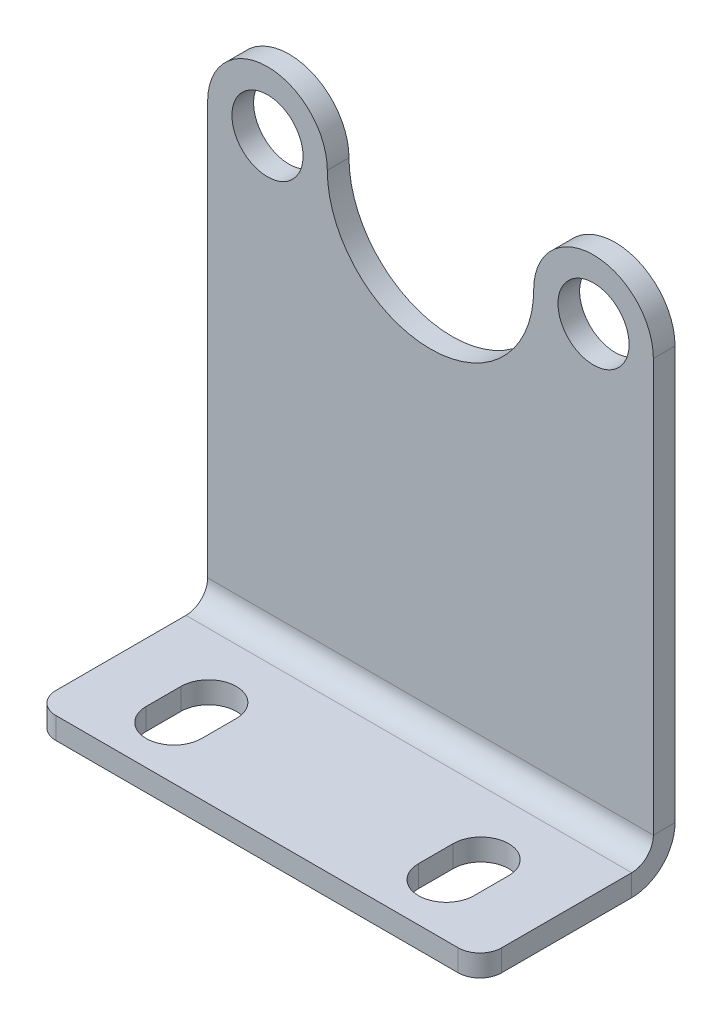
ISO-10303-21;
HEADER;
FILE_DESCRIPTION(('STEP AP214'),'2;1');
FILE_NAME('part.step','',(''),(''),'','','');
FILE_SCHEMA(('AUTOMOTIVE_DESIGN { 1 0 10303 214 1 1 1 1 }'));
ENDSEC;
DATA;
#1=APPLICATION_CONTEXT('core data for automotive mechanical design processes');
#2=APPLICATION_PROTOCOL_DEFINITION('international standard','automotive_design',2000,#1);
#3=PRODUCT_CONTEXT('',#1,'mechanical');
#4=PRODUCT('Part','Part','',(#3));
#5=PRODUCT_RELATED_PRODUCT_CATEGORY('part','',(#4));
#6=PRODUCT_DEFINITION_FORMATION('','',#4);
#7=PRODUCT_DEFINITION_CONTEXT('part definition',#1,'design');
#8=PRODUCT_DEFINITION('design','',#6,#7);
#9=PRODUCT_DEFINITION_SHAPE('','',#8);
#10=(LENGTH_UNIT() NAMED_UNIT(*) SI_UNIT(.MILLI.,.METRE.));
#11=(NAMED_UNIT(*) PLANE_ANGLE_UNIT() SI_UNIT($,.RADIAN.));
#12=(NAMED_UNIT(*) SI_UNIT($,.STERADIAN.) SOLID_ANGLE_UNIT());
#13=UNCERTAINTY_MEASURE_WITH_UNIT(LENGTH_MEASURE(1.E-05),#10,'distance_accuracy_value','');
#14=(GEOMETRIC_REPRESENTATION_CONTEXT(3) GLOBAL_UNCERTAINTY_ASSIGNED_CONTEXT((#13)) GLOBAL_UNIT_ASSIGNED_CONTEXT((#10,
#11,#12)) REPRESENTATION_CONTEXT('',''));
#15=CARTESIAN_POINT('',(0.,0.,0.));
#16=DIRECTION('',(0.,0.,1.));
#17=DIRECTION('',(1.,0.,0.));
#18=AXIS2_PLACEMENT_3D('',#15,#16,#17);
#19=CARTESIAN_POINT('',(56.642,3.175,15.73022));
#20=DIRECTION('',(1.,0.,0.));
#21=DIRECTION('',(0.,0.,-1.));
#22=AXIS2_PLACEMENT_3D('',#19,#20,#21);
#23=PLANE('',#22);
#24=DIRECTION('',(0.,1.,0.));
#25=VECTOR('',#24,1.);
#26=CARTESIAN_POINT('',(56.642,3.175,15.73022));
#27=LINE('',#26,#25);
#28=CARTESIAN_POINT('',(56.642,0.,15.73022));
#29=VERTEX_POINT('',#28);
#30=CARTESIAN_POINT('',(56.642,3.175,15.73022));
#31=VERTEX_POINT('',#30);
#32=EDGE_CURVE('E11',#29,#31,#27,.T.);
#33=ORIENTED_EDGE('',*,*,#32,.F.);
#34=DIRECTION('',(0.,0.,1.));
#35=VECTOR('',#34,1.);
#36=CARTESIAN_POINT('',(56.642,0.,0.));
#37=LINE('',#36,#35);
#38=CARTESIAN_POINT('',(56.642,0.,20.81022));
#39=VERTEX_POINT('',#38);
#40=EDGE_CURVE('E151',#39,#29,#37,.F.);
#41=ORIENTED_EDGE('',*,*,#40,.F.);
#42=DIRECTION('',(0.,1.,0.));
#43=VECTOR('',#42,1.);
#44=CARTESIAN_POINT('',(56.642,3.175,20.81022));
#45=LINE('',#44,#43);
#46=CARTESIAN_POINT('',(56.642,3.175,20.81022));
#47=VERTEX_POINT('',#46);
#48=EDGE_CURVE('E54',#39,#47,#45,.T.);
#49=ORIENTED_EDGE('',*,*,#48,.T.);
#50=DIRECTION('',(0.,0.,-1.));
#51=VECTOR('',#50,1.);
#52=CARTESIAN_POINT('',(56.642,3.175,15.73022));
#53=LINE('',#52,#51);
#54=EDGE_CURVE('E243',#47,#31,#53,.T.);
#55=ORIENTED_EDGE('',*,*,#54,.T.);
#56=EDGE_LOOP('',(#33,#41,#49,#55));
#57=FACE_BOUND('',#56,.T.);
#58=ADVANCED_FACE('F43',(#57),#23,.F.);
#59=CARTESIAN_POINT('',(52.578,3.175,20.81022));
#60=DIRECTION('',(0.,1.,0.));
#61=DIRECTION('',(0.,0.,1.));
#62=AXIS2_PLACEMENT_3D('',#59,#60,#61);
#63=CYLINDRICAL_SURFACE('',#62,4.064);
#64=ORIENTED_EDGE('',*,*,#48,.F.);
#65=CARTESIAN_POINT('',(52.578,0.,20.81022));
#66=DIRECTION('',(0.,1.,0.));
#67=DIRECTION('',(0.,0.,1.));
#68=AXIS2_PLACEMENT_3D('',#65,#66,#67);
#69=CIRCLE('',#68,4.064);
#70=CARTESIAN_POINT('',(48.514,0.,20.81022));
#71=VERTEX_POINT('',#70);
#72=EDGE_CURVE('E168',#71,#39,#69,.T.);
#73=ORIENTED_EDGE('',*,*,#72,.F.);
#74=DIRECTION('',(0.,1.,0.));
#75=VECTOR('',#74,1.);
#76=CARTESIAN_POINT('',(48.514,3.175,20.81022));
#77=LINE('',#76,#75);
#78=CARTESIAN_POINT('',(48.514,3.175,20.81022));
#79=VERTEX_POINT('',#78);
#80=EDGE_CURVE('E143',#71,#79,#77,.T.);
#81=ORIENTED_EDGE('',*,*,#80,.T.);
#82=CARTESIAN_POINT('',(52.578,3.175,20.81022));
#83=DIRECTION('',(0.,1.,0.));
#84=DIRECTION('',(0.,0.,-1.));
#85=AXIS2_PLACEMENT_3D('',#82,#83,#84);
#86=CIRCLE('',#85,4.064);
#87=EDGE_CURVE('E251',#79,#47,#86,.T.);
#88=ORIENTED_EDGE('',*,*,#87,.T.);
#89=EDGE_LOOP('',(#64,#73,#81,#88));
#90=FACE_BOUND('',#89,.T.);
#91=ADVANCED_FACE('F254',(#90),#63,.F.);
#92=CARTESIAN_POINT('',(48.514,3.175,15.73022));
#93=DIRECTION('',(-1.,0.,0.));
#94=DIRECTION('',(0.,0.,1.));
#95=AXIS2_PLACEMENT_3D('',#92,#93,#94);
#96=PLANE('',#95);
#97=ORIENTED_EDGE('',*,*,#80,.F.);
#98=DIRECTION('',(0.,0.,1.));
#99=VECTOR('',#98,1.);
#100=CARTESIAN_POINT('',(48.514,0.,0.));
#101=LINE('',#100,#99);
#102=CARTESIAN_POINT('',(48.514,0.,15.73022));
#103=VERTEX_POINT('',#102);
#104=EDGE_CURVE('E149',#103,#71,#101,.T.);
#105=ORIENTED_EDGE('',*,*,#104,.F.);
#106=DIRECTION('',(0.,1.,0.));
#107=VECTOR('',#106,1.);
#108=CARTESIAN_POINT('',(48.514,3.175,15.73022));
#109=LINE('',#108,#107);
#110=CARTESIAN_POINT('',(48.514,3.175,15.73022));
#111=VERTEX_POINT('',#110);
#112=EDGE_CURVE('E47',#103,#111,#109,.T.);
#113=ORIENTED_EDGE('',*,*,#112,.T.);
#114=DIRECTION('',(0.,0.,1.));
#115=VECTOR('',#114,1.);
#116=CARTESIAN_POINT('',(48.514,3.175,15.73022));
#117=LINE('',#116,#115);
#118=EDGE_CURVE('E496',#111,#79,#117,.T.);
#119=ORIENTED_EDGE('',*,*,#118,.T.);
#120=EDGE_LOOP('',(#97,#105,#113,#119));
#121=FACE_BOUND('',#120,.T.);
#122=ADVANCED_FACE('F154',(#121),#96,.F.);
#123=CARTESIAN_POINT('',(16.764,3.175,15.73022));
#124=DIRECTION('',(1.,0.,0.));
#125=DIRECTION('',(0.,0.,-1.));
#126=AXIS2_PLACEMENT_3D('',#123,#124,#125);
#127=PLANE('',#126);
#128=DIRECTION('',(0.,1.,0.));
#129=VECTOR('',#128,1.);
#130=CARTESIAN_POINT('',(16.764,3.175,15.73022));
#131=LINE('',#130,#129);
#132=CARTESIAN_POINT('',(16.764,0.,15.73022));
#133=VERTEX_POINT('',#132);
#134=CARTESIAN_POINT('',(16.764,3.175,15.73022));
#135=VERTEX_POINT('',#134);
#136=EDGE_CURVE('E144',#133,#135,#131,.T.);
#137=ORIENTED_EDGE('',*,*,#136,.F.);
#138=DIRECTION('',(0.,0.,1.));
#139=VECTOR('',#138,1.);
#140=CARTESIAN_POINT('',(16.764,0.,0.));
#141=LINE('',#140,#139);
#142=CARTESIAN_POINT('',(16.764,0.,20.81022));
#143=VERTEX_POINT('',#142);
#144=EDGE_CURVE('E162',#143,#133,#141,.F.);
#145=ORIENTED_EDGE('',*,*,#144,.F.);
#146=DIRECTION('',(0.,1.,0.));
#147=VECTOR('',#146,1.);
#148=CARTESIAN_POINT('',(16.764,3.175,20.81022));
#149=LINE('',#148,#147);
#150=CARTESIAN_POINT('',(16.764,3.175,20.81022));
#151=VERTEX_POINT('',#150);
#152=EDGE_CURVE('E225',#143,#151,#149,.T.);
#153=ORIENTED_EDGE('',*,*,#152,.T.);
#154=DIRECTION('',(0.,0.,-1.));
#155=VECTOR('',#154,1.);
#156=CARTESIAN_POINT('',(16.764,3.175,15.73022));
#157=LINE('',#156,#155);
#158=EDGE_CURVE('E490',#151,#135,#157,.T.);
#159=ORIENTED_EDGE('',*,*,#158,.T.);
#160=EDGE_LOOP('',(#137,#145,#153,#159));
#161=FACE_BOUND('',#160,.T.);
#162=ADVANCED_FACE('F508',(#161),#127,.F.);
#163=CARTESIAN_POINT('',(12.7,3.175,20.81022));
#164=DIRECTION('',(0.,1.,0.));
#165=DIRECTION('',(0.,0.,1.));
#166=AXIS2_PLACEMENT_3D('',#163,#164,#165);
#167=CYLINDRICAL_SURFACE('',#166,4.064);
#168=ORIENTED_EDGE('',*,*,#152,.F.);
#169=CARTESIAN_POINT('',(12.7,0.,20.81022));
#170=DIRECTION('',(0.,1.,0.));
#171=DIRECTION('',(0.,0.,1.));
#172=AXIS2_PLACEMENT_3D('',#169,#170,#171);
#173=CIRCLE('',#172,4.064);
#174=CARTESIAN_POINT('',(8.636,0.,20.81022));
#175=VERTEX_POINT('',#174);
#176=EDGE_CURVE('E157',#175,#143,#173,.T.);
#177=ORIENTED_EDGE('',*,*,#176,.F.);
#178=DIRECTION('',(0.,1.,0.));
#179=VECTOR('',#178,1.);
#180=CARTESIAN_POINT('',(8.636,3.175,20.81022));
#181=LINE('',#180,#179);
#182=CARTESIAN_POINT('',(8.636,3.175,20.81022));
#183=VERTEX_POINT('',#182);
#184=EDGE_CURVE('E221',#175,#183,#181,.T.);
#185=ORIENTED_EDGE('',*,*,#184,.T.);
#186=CARTESIAN_POINT('',(12.7,3.175,20.81022));
#187=DIRECTION('',(0.,1.,0.));
#188=DIRECTION('',(0.,0.,1.));
#189=AXIS2_PLACEMENT_3D('',#186,#187,#188);
#190=CIRCLE('',#189,4.064);
#191=EDGE_CURVE('E393',#183,#151,#190,.T.);
#192=ORIENTED_EDGE('',*,*,#191,.T.);
#193=EDGE_LOOP('',(#168,#177,#185,#192));
#194=FACE_BOUND('',#193,.T.);
#195=ADVANCED_FACE('F391',(#194),#167,.F.);
#196=CARTESIAN_POINT('',(8.636,3.175,15.73022));
#197=DIRECTION('',(-1.,0.,0.));
#198=DIRECTION('',(0.,0.,1.));
#199=AXIS2_PLACEMENT_3D('',#196,#197,#198);
#200=PLANE('',#199);
#201=ORIENTED_EDGE('',*,*,#184,.F.);
#202=DIRECTION('',(0.,0.,1.));
#203=VECTOR('',#202,1.);
#204=CARTESIAN_POINT('',(8.636,0.,0.));
#205=LINE('',#204,#203);
#206=CARTESIAN_POINT('',(8.636,0.,15.73022));
#207=VERTEX_POINT('',#206);
#208=EDGE_CURVE('E354',#207,#175,#205,.T.);
#209=ORIENTED_EDGE('',*,*,#208,.F.);
#210=DIRECTION('',(0.,1.,0.));
#211=VECTOR('',#210,1.);
#212=CARTESIAN_POINT('',(8.636,3.175,15.73022));
#213=LINE('',#212,#211);
#214=CARTESIAN_POINT('',(8.636,3.175,15.73022));
#215=VERTEX_POINT('',#214);
#216=EDGE_CURVE('E217',#207,#215,#213,.T.);
#217=ORIENTED_EDGE('',*,*,#216,.T.);
#218=DIRECTION('',(0.,0.,1.));
#219=VECTOR('',#218,1.);
#220=CARTESIAN_POINT('',(8.636,3.175,15.73022));
#221=LINE('',#220,#219);
#222=EDGE_CURVE('E387',#215,#183,#221,.T.);
#223=ORIENTED_EDGE('',*,*,#222,.T.);
#224=EDGE_LOOP('',(#201,#209,#217,#223));
#225=FACE_BOUND('',#224,.T.);
#226=ADVANCED_FACE('F382',(#225),#200,.F.);
#227=CARTESIAN_POINT('',(0.,3.175,3.175));
#228=DIRECTION('',(-1.,0.,0.));
#229=DIRECTION('',(0.,0.,1.));
#230=AXIS2_PLACEMENT_3D('',#227,#228,#229);
#231=PLANE('',#230);
#232=DIRECTION('',(0.,1.,0.));
#233=VECTOR('',#232,1.);
#234=CARTESIAN_POINT('',(0.,3.175,6.35));
#235=LINE('',#234,#233);
#236=CARTESIAN_POINT('',(0.,0.,6.35));
#237=VERTEX_POINT('',#236);
#238=CARTESIAN_POINT('',(0.,3.175,6.35));
#239=VERTEX_POINT('',#238);
#240=EDGE_CURVE('E213',#237,#239,#235,.T.);
#241=ORIENTED_EDGE('',*,*,#240,.F.);
#242=DIRECTION('',(0.,0.,1.));
#243=VECTOR('',#242,1.);
#244=CARTESIAN_POINT('',(0.,0.,0.));
#245=LINE('',#244,#243);
#246=CARTESIAN_POINT('',(0.,0.,25.4));
#247=VERTEX_POINT('',#246);
#248=EDGE_CURVE('E342',#237,#247,#245,.T.);
#249=ORIENTED_EDGE('',*,*,#248,.T.);
#250=DIRECTION('',(0.,1.,0.));
#251=VECTOR('',#250,1.);
#252=CARTESIAN_POINT('',(0.,3.175,25.4));
#253=LINE('',#252,#251);
#254=CARTESIAN_POINT('',(0.,3.175,25.4));
#255=VERTEX_POINT('',#254);
#256=EDGE_CURVE('E209',#247,#255,#253,.T.);
#257=ORIENTED_EDGE('',*,*,#256,.T.);
#258=DIRECTION('',(0.,0.,1.));
#259=VECTOR('',#258,1.);
#260=CARTESIAN_POINT('',(0.,3.175,3.175));
#261=LINE('',#260,#259);
#262=EDGE_CURVE('E421',#239,#255,#261,.T.);
#263=ORIENTED_EDGE('',*,*,#262,.F.);
#264=EDGE_LOOP('',(#241,#249,#257,#263));
#265=FACE_BOUND('',#264,.T.);
#266=ADVANCED_FACE('F422',(#265),#231,.T.);
#267=CARTESIAN_POINT('',(3.175,3.175,25.4));
#268=DIRECTION('',(0.,1.,0.));
#269=DIRECTION('',(0.,0.,1.));
#270=AXIS2_PLACEMENT_3D('',#267,#268,#269);
#271=CYLINDRICAL_SURFACE('',#270,3.175);
#272=ORIENTED_EDGE('',*,*,#256,.F.);
#273=CARTESIAN_POINT('',(3.175,0.,25.4));
#274=DIRECTION('',(0.,1.,0.));
#275=DIRECTION('',(0.,0.,1.));
#276=AXIS2_PLACEMENT_3D('',#273,#274,#275);
#277=CIRCLE('',#276,3.175);
#278=CARTESIAN_POINT('',(3.175,0.,28.575));
#279=VERTEX_POINT('',#278);
#280=EDGE_CURVE('E350',#247,#279,#277,.T.);
#281=ORIENTED_EDGE('',*,*,#280,.T.);
#282=DIRECTION('',(0.,1.,0.));
#283=VECTOR('',#282,1.);
#284=CARTESIAN_POINT('',(3.175,3.175,28.575));
#285=LINE('',#284,#283);
#286=CARTESIAN_POINT('',(3.175,3.175,28.575));
#287=VERTEX_POINT('',#286);
#288=EDGE_CURVE('E205',#279,#287,#285,.T.);
#289=ORIENTED_EDGE('',*,*,#288,.T.);
#290=CARTESIAN_POINT('',(3.175,3.175,25.4));
#291=DIRECTION('',(0.,1.,0.));
#292=DIRECTION('',(0.,0.,1.));
#293=AXIS2_PLACEMENT_3D('',#290,#291,#292);
#294=CIRCLE('',#293,3.175);
#295=EDGE_CURVE('E428',#255,#287,#294,.T.);
#296=ORIENTED_EDGE('',*,*,#295,.F.);
#297=EDGE_LOOP('',(#272,#281,#289,#296));
#298=FACE_BOUND('',#297,.T.);
#299=ADVANCED_FACE('F476',(#298),#271,.T.);
#300=CARTESIAN_POINT('',(0.,3.175,28.575));
#301=DIRECTION('',(0.,0.,1.));
#302=DIRECTION('',(1.,0.,0.));
#303=AXIS2_PLACEMENT_3D('',#300,#301,#302);
#304=PLANE('',#303);
#305=ORIENTED_EDGE('',*,*,#288,.F.);
#306=DIRECTION('',(1.,0.,0.));
#307=VECTOR('',#306,1.);
#308=CARTESIAN_POINT('',(0.,0.,28.575));
#309=LINE('',#308,#307);
#310=CARTESIAN_POINT('',(62.103,0.,28.575));
#311=VERTEX_POINT('',#310);
#312=EDGE_CURVE('E336',#279,#311,#309,.T.);
#313=ORIENTED_EDGE('',*,*,#312,.T.);
#314=DIRECTION('',(0.,1.,0.));
#315=VECTOR('',#314,1.);
#316=CARTESIAN_POINT('',(62.103,3.175,28.575));
#317=LINE('',#316,#315);
#318=CARTESIAN_POINT('',(62.103,3.175,28.575));
#319=VERTEX_POINT('',#318);
#320=EDGE_CURVE('E201',#311,#319,#317,.T.);
#321=ORIENTED_EDGE('',*,*,#320,.T.);
#322=DIRECTION('',(1.,0.,0.));
#323=VECTOR('',#322,1.);
#324=CARTESIAN_POINT('',(0.,3.175,28.575));
#325=LINE('',#324,#323);
#326=EDGE_CURVE('E304',#287,#319,#325,.T.);
#327=ORIENTED_EDGE('',*,*,#326,.F.);
#328=EDGE_LOOP('',(#305,#313,#321,#327));
#329=FACE_BOUND('',#328,.T.);
#330=ADVANCED_FACE('F516',(#329),#304,.T.);
#331=CARTESIAN_POINT('',(62.103,3.175,25.4));
#332=DIRECTION('',(0.,1.,0.));
#333=DIRECTION('',(0.,0.,1.));
#334=AXIS2_PLACEMENT_3D('',#331,#332,#333);
#335=CYLINDRICAL_SURFACE('',#334,3.175);
#336=ORIENTED_EDGE('',*,*,#320,.F.);
#337=CARTESIAN_POINT('',(62.103,0.,25.4));
#338=DIRECTION('',(0.,1.,0.));
#339=DIRECTION('',(0.,0.,1.));
#340=AXIS2_PLACEMENT_3D('',#337,#338,#339);
#341=CIRCLE('',#340,3.175);
#342=CARTESIAN_POINT('',(65.278,0.,25.4));
#343=VERTEX_POINT('',#342);
#344=EDGE_CURVE('E343',#311,#343,#341,.T.);
#345=ORIENTED_EDGE('',*,*,#344,.T.);
#346=DIRECTION('',(0.,1.,0.));
#347=VECTOR('',#346,1.);
#348=CARTESIAN_POINT('',(65.278,3.175,25.4));
#349=LINE('',#348,#347);
#350=CARTESIAN_POINT('',(65.278,3.175,25.4));
#351=VERTEX_POINT('',#350);
#352=EDGE_CURVE('E197',#343,#351,#349,.T.);
#353=ORIENTED_EDGE('',*,*,#352,.T.);
#354=CARTESIAN_POINT('',(62.103,3.175,25.4));
#355=DIRECTION('',(0.,1.,0.));
#356=DIRECTION('',(0.,0.,1.));
#357=AXIS2_PLACEMENT_3D('',#354,#355,#356);
#358=CIRCLE('',#357,3.175);
#359=EDGE_CURVE('E439',#319,#351,#358,.T.);
#360=ORIENTED_EDGE('',*,*,#359,.F.);
#361=EDGE_LOOP('',(#336,#345,#353,#360));
#362=FACE_BOUND('',#361,.T.);
#363=ADVANCED_FACE('F520',(#362),#335,.T.);
#364=CARTESIAN_POINT('',(65.278,3.175,3.175));
#365=DIRECTION('',(1.,0.,0.));
#366=DIRECTION('',(0.,0.,-1.));
#367=AXIS2_PLACEMENT_3D('',#364,#365,#366);
#368=PLANE('',#367);
#369=ORIENTED_EDGE('',*,*,#352,.F.);
#370=DIRECTION('',(0.,0.,1.));
#371=VECTOR('',#370,1.);
#372=CARTESIAN_POINT('',(65.278,0.,0.));
#373=LINE('',#372,#371);
#374=CARTESIAN_POINT('',(65.278,0.,6.35));
#375=VERTEX_POINT('',#374);
#376=EDGE_CURVE('E338',#343,#375,#373,.F.);
#377=ORIENTED_EDGE('',*,*,#376,.T.);
#378=DIRECTION('',(0.,1.,0.));
#379=VECTOR('',#378,1.);
#380=CARTESIAN_POINT('',(65.278,3.175,6.35));
#381=LINE('',#380,#379);
#382=CARTESIAN_POINT('',(65.278,3.175,6.35));
#383=VERTEX_POINT('',#382);
#384=EDGE_CURVE('E193',#375,#383,#381,.T.);
#385=ORIENTED_EDGE('',*,*,#384,.T.);
#386=DIRECTION('',(0.,0.,-1.));
#387=VECTOR('',#386,1.);
#388=CARTESIAN_POINT('',(65.278,3.175,3.175));
#389=LINE('',#388,#387);
#390=EDGE_CURVE('E429',#351,#383,#389,.T.);
#391=ORIENTED_EDGE('',*,*,#390,.F.);
#392=EDGE_LOOP('',(#369,#377,#385,#391));
#393=FACE_BOUND('',#392,.T.);
#394=ADVANCED_FACE('F541',(#393),#368,.T.);
#395=CARTESIAN_POINT('',(65.278,6.35,6.35));
#396=DIRECTION('',(1.,0.,0.));
#397=DIRECTION('',(0.,0.,-1.));
#398=AXIS2_PLACEMENT_3D('',#395,#396,#397);
#399=PLANE('',#398);
#400=ORIENTED_EDGE('',*,*,#384,.F.);
#401=CARTESIAN_POINT('',(65.278,6.35,6.35));
#402=DIRECTION('',(1.,0.,0.));
#403=DIRECTION('',(0.,0.,-1.));
#404=AXIS2_PLACEMENT_3D('',#401,#402,#403);
#405=CIRCLE('',#404,6.35);
#406=CARTESIAN_POINT('',(65.278,6.35,0.));
#407=VERTEX_POINT('',#406);
#408=EDGE_CURVE('E332',#375,#407,#405,.T.);
#409=ORIENTED_EDGE('',*,*,#408,.T.);
#410=DIRECTION('',(0.,0.,1.));
#411=VECTOR('',#410,1.);
#412=CARTESIAN_POINT('',(65.278,6.35,3.175));
#413=LINE('',#412,#411);
#414=CARTESIAN_POINT('',(65.278,6.35,3.175));
#415=VERTEX_POINT('',#414);
#416=EDGE_CURVE('E190',#407,#415,#413,.T.);
#417=ORIENTED_EDGE('',*,*,#416,.T.);
#418=CARTESIAN_POINT('',(65.278,6.35,6.35));
#419=DIRECTION('',(-1.,0.,0.));
#420=DIRECTION('',(0.,0.,1.));
#421=AXIS2_PLACEMENT_3D('',#418,#419,#420);
#422=CIRCLE('',#421,3.175);
#423=EDGE_CURVE('E299',#383,#415,#422,.F.);
#424=ORIENTED_EDGE('',*,*,#423,.F.);
#425=EDGE_LOOP('',(#400,#409,#417,#424));
#426=FACE_BOUND('',#425,.T.);
#427=ADVANCED_FACE('F444',(#426),#399,.T.);
#428=CARTESIAN_POINT('',(65.278,0.,3.175));
#429=DIRECTION('',(1.,0.,0.));
#430=DIRECTION('',(0.,1.,0.));
#431=AXIS2_PLACEMENT_3D('',#428,#429,#430);
#432=PLANE('',#431);
#433=ORIENTED_EDGE('',*,*,#416,.F.);
#434=DIRECTION('',(0.,1.,0.));
#435=VECTOR('',#434,1.);
#436=CARTESIAN_POINT('',(65.278,66.802,0.));
#437=LINE('',#436,#435);
#438=CARTESIAN_POINT('',(65.278,66.802,0.));
#439=VERTEX_POINT('',#438);
#440=EDGE_CURVE('E171',#407,#439,#437,.T.);
#441=ORIENTED_EDGE('',*,*,#440,.T.);
#442=DIRECTION('',(0.,0.,1.));
#443=VECTOR('',#442,1.);
#444=CARTESIAN_POINT('',(65.278,66.802,3.175));
#445=LINE('',#444,#443);
#446=CARTESIAN_POINT('',(65.278,66.802,3.175));
#447=VERTEX_POINT('',#446);
#448=EDGE_CURVE('E186',#439,#447,#445,.T.);
#449=ORIENTED_EDGE('',*,*,#448,.T.);
#450=DIRECTION('',(0.,1.,0.));
#451=VECTOR('',#450,1.);
#452=CARTESIAN_POINT('',(65.278,0.,3.175));
#453=LINE('',#452,#451);
#454=EDGE_CURVE('E256',#415,#447,#453,.T.);
#455=ORIENTED_EDGE('',*,*,#454,.F.);
#456=EDGE_LOOP('',(#433,#441,#449,#455));
#457=FACE_BOUND('',#456,.T.);
#458=ADVANCED_FACE('F448',(#457),#432,.T.);
#459=CARTESIAN_POINT('',(56.515,66.802,3.175));
#460=DIRECTION('',(0.,0.,1.));
#461=DIRECTION('',(1.,0.,0.));
#462=AXIS2_PLACEMENT_3D('',#459,#460,#461);
#463=CYLINDRICAL_SURFACE('',#462,8.763);
#464=ORIENTED_EDGE('',*,*,#448,.F.);
#465=CARTESIAN_POINT('',(56.515,66.802,0.));
#466=DIRECTION('',(0.,0.,1.));
#467=DIRECTION('',(1.,0.,0.));
#468=AXIS2_PLACEMENT_3D('',#465,#466,#467);
#469=CIRCLE('',#468,8.763);
#470=CARTESIAN_POINT('',(47.752,66.802,0.));
#471=VERTEX_POINT('',#470);
#472=EDGE_CURVE('E325',#439,#471,#469,.T.);
#473=ORIENTED_EDGE('',*,*,#472,.T.);
#474=DIRECTION('',(0.,0.,1.));
#475=VECTOR('',#474,1.);
#476=CARTESIAN_POINT('',(47.752,66.802,3.175));
#477=LINE('',#476,#475);
#478=CARTESIAN_POINT('',(47.752,66.802,3.175));
#479=VERTEX_POINT('',#478);
#480=EDGE_CURVE('E182',#471,#479,#477,.T.);
#481=ORIENTED_EDGE('',*,*,#480,.T.);
#482=CARTESIAN_POINT('',(56.515,66.802,3.175));
#483=DIRECTION('',(0.,0.,1.));
#484=DIRECTION('',(1.,0.,0.));
#485=AXIS2_PLACEMENT_3D('',#482,#483,#484);
#486=CIRCLE('',#485,8.763);
#487=EDGE_CURVE('E261',#447,#479,#486,.T.);
#488=ORIENTED_EDGE('',*,*,#487,.F.);
#489=EDGE_LOOP('',(#464,#473,#481,#488));
#490=FACE_BOUND('',#489,.T.);
#491=ADVANCED_FACE('F608',(#490),#463,.T.);
#492=CARTESIAN_POINT('',(32.639,66.802,3.175));
#493=DIRECTION('',(0.,0.,1.));
#494=DIRECTION('',(1.,0.,0.));
#495=AXIS2_PLACEMENT_3D('',#492,#493,#494);
#496=CYLINDRICAL_SURFACE('',#495,15.113);
#497=ORIENTED_EDGE('',*,*,#480,.F.);
#498=CARTESIAN_POINT('',(32.639,66.802,0.));
#499=DIRECTION('',(0.,0.,-1.));
#500=DIRECTION('',(-1.,0.,0.));
#501=AXIS2_PLACEMENT_3D('',#498,#499,#500);
#502=CIRCLE('',#501,15.113);
#503=CARTESIAN_POINT('',(17.526,66.802,0.));
#504=VERTEX_POINT('',#503);
#505=EDGE_CURVE('E321',#471,#504,#502,.T.);
#506=ORIENTED_EDGE('',*,*,#505,.T.);
#507=DIRECTION('',(0.,0.,1.));
#508=VECTOR('',#507,1.);
#509=CARTESIAN_POINT('',(17.526,66.802,3.175));
#510=LINE('',#509,#508);
#511=CARTESIAN_POINT('',(17.526,66.802,3.175));
#512=VERTEX_POINT('',#511);
#513=EDGE_CURVE('E178',#504,#512,#510,.T.);
#514=ORIENTED_EDGE('',*,*,#513,.T.);
#515=CARTESIAN_POINT('',(32.639,66.802,3.175));
#516=DIRECTION('',(0.,0.,-1.));
#517=DIRECTION('',(1.,0.,0.));
#518=AXIS2_PLACEMENT_3D('',#515,#516,#517);
#519=CIRCLE('',#518,15.113);
#520=EDGE_CURVE('E268',#479,#512,#519,.T.);
#521=ORIENTED_EDGE('',*,*,#520,.F.);
#522=EDGE_LOOP('',(#497,#506,#514,#521));
#523=FACE_BOUND('',#522,.T.);
#524=ADVANCED_FACE('F617',(#523),#496,.F.);
#525=CARTESIAN_POINT('',(8.76299999999999,66.802,3.175));
#526=DIRECTION('',(0.,0.,1.));
#527=DIRECTION('',(1.,0.,0.));
#528=AXIS2_PLACEMENT_3D('',#525,#526,#527);
#529=CYLINDRICAL_SURFACE('',#528,8.76299999999999);
#530=ORIENTED_EDGE('',*,*,#513,.F.);
#531=CARTESIAN_POINT('',(8.76299999999999,66.802,0.));
#532=DIRECTION('',(0.,0.,1.));
#533=DIRECTION('',(1.,0.,0.));
#534=AXIS2_PLACEMENT_3D('',#531,#532,#533);
#535=CIRCLE('',#534,8.76299999999999);
#536=CARTESIAN_POINT('',(0.,66.802,0.));
#537=VERTEX_POINT('',#536);
#538=EDGE_CURVE('E317',#504,#537,#535,.T.);
#539=ORIENTED_EDGE('',*,*,#538,.T.);
#540=DIRECTION('',(0.,0.,1.));
#541=VECTOR('',#540,1.);
#542=CARTESIAN_POINT('',(0.,66.802,3.175));
#543=LINE('',#542,#541);
#544=CARTESIAN_POINT('',(0.,66.802,3.175));
#545=VERTEX_POINT('',#544);
#546=EDGE_CURVE('E174',#537,#545,#543,.T.);
#547=ORIENTED_EDGE('',*,*,#546,.T.);
#548=CARTESIAN_POINT('',(8.76299999999999,66.802,3.175));
#549=DIRECTION('',(0.,0.,1.));
#550=DIRECTION('',(1.,0.,0.));
#551=AXIS2_PLACEMENT_3D('',#548,#549,#550);
#552=CIRCLE('',#551,8.76299999999999);
#553=EDGE_CURVE('E272',#512,#545,#552,.T.);
#554=ORIENTED_EDGE('',*,*,#553,.F.);
#555=EDGE_LOOP('',(#530,#539,#547,#554));
#556=FACE_BOUND('',#555,.T.);
#557=ADVANCED_FACE('F458',(#556),#529,.T.);
#558=CARTESIAN_POINT('',(0.,0.,3.175));
#559=DIRECTION('',(-1.,0.,0.));
#560=DIRECTION('',(0.,-1.,0.));
#561=AXIS2_PLACEMENT_3D('',#558,#559,#560);
#562=PLANE('',#561);
#563=ORIENTED_EDGE('',*,*,#546,.F.);
#564=DIRECTION('',(0.,1.,0.));
#565=VECTOR('',#564,1.);
#566=CARTESIAN_POINT('',(0.,66.802,0.));
#567=LINE('',#566,#565);
#568=CARTESIAN_POINT('',(0.,6.35,0.));
#569=VERTEX_POINT('',#568);
#570=EDGE_CURVE('E313',#537,#569,#567,.F.);
#571=ORIENTED_EDGE('',*,*,#570,.T.);
#572=DIRECTION('',(0.,0.,1.));
#573=VECTOR('',#572,1.);
#574=CARTESIAN_POINT('',(0.,6.35,3.175));
#575=LINE('',#574,#573);
#576=CARTESIAN_POINT('',(0.,6.35,3.175));
#577=VERTEX_POINT('',#576);
#578=EDGE_CURVE('E62',#569,#577,#575,.T.);
#579=ORIENTED_EDGE('',*,*,#578,.T.);
#580=DIRECTION('',(0.,-1.,0.));
#581=VECTOR('',#580,1.);
#582=CARTESIAN_POINT('',(0.,0.,3.175));
#583=LINE('',#582,#581);
#584=EDGE_CURVE('E276',#545,#577,#583,.T.);
#585=ORIENTED_EDGE('',*,*,#584,.F.);
#586=EDGE_LOOP('',(#563,#571,#579,#585));
#587=FACE_BOUND('',#586,.T.);
#588=ADVANCED_FACE('F454',(#587),#562,.T.);
#589=CARTESIAN_POINT('',(12.7,3.175,15.73022));
#590=DIRECTION('',(0.,1.,0.));
#591=DIRECTION('',(0.,0.,1.));
#592=AXIS2_PLACEMENT_3D('',#589,#590,#591);
#593=CYLINDRICAL_SURFACE('',#592,4.064);
#594=CARTESIAN_POINT('',(12.7,0.,15.73022));
#595=DIRECTION('',(0.,1.,0.));
#596=DIRECTION('',(0.,0.,1.));
#597=AXIS2_PLACEMENT_3D('',#594,#595,#596);
#598=CIRCLE('',#597,4.064);
#599=EDGE_CURVE('E166',#133,#207,#598,.T.);
#600=ORIENTED_EDGE('',*,*,#599,.F.);
#601=ORIENTED_EDGE('',*,*,#136,.T.);
#602=CARTESIAN_POINT('',(12.7,3.175,15.73022));
#603=DIRECTION('',(0.,1.,0.));
#604=DIRECTION('',(0.,0.,1.));
#605=AXIS2_PLACEMENT_3D('',#602,#603,#604);
#606=CIRCLE('',#605,4.064);
#607=EDGE_CURVE('E484',#135,#215,#606,.T.);
#608=ORIENTED_EDGE('',*,*,#607,.T.);
#609=ORIENTED_EDGE('',*,*,#216,.F.);
#610=EDGE_LOOP('',(#600,#601,#608,#609));
#611=FACE_BOUND('',#610,.T.);
#612=ADVANCED_FACE('F510',(#611),#593,.F.);
#613=CARTESIAN_POINT('',(52.578,3.175,15.73022));
#614=DIRECTION('',(0.,1.,0.));
#615=DIRECTION('',(0.,0.,1.));
#616=AXIS2_PLACEMENT_3D('',#613,#614,#615);
#617=CYLINDRICAL_SURFACE('',#616,4.064);
#618=CARTESIAN_POINT('',(52.578,0.,15.73022));
#619=DIRECTION('',(0.,1.,0.));
#620=DIRECTION('',(0.,0.,1.));
#621=AXIS2_PLACEMENT_3D('',#618,#619,#620);
#622=CIRCLE('',#621,4.064);
#623=EDGE_CURVE('E134',#29,#103,#622,.T.);
#624=ORIENTED_EDGE('',*,*,#623,.F.);
#625=ORIENTED_EDGE('',*,*,#32,.T.);
#626=CARTESIAN_POINT('',(52.578,3.175,15.73022));
#627=DIRECTION('',(0.,1.,0.));
#628=DIRECTION('',(0.,0.,-1.));
#629=AXIS2_PLACEMENT_3D('',#626,#627,#628);
#630=CIRCLE('',#629,4.064);
#631=EDGE_CURVE('E137',#31,#111,#630,.T.);
#632=ORIENTED_EDGE('',*,*,#631,.T.);
#633=ORIENTED_EDGE('',*,*,#112,.F.);
#634=EDGE_LOOP('',(#624,#625,#632,#633));
#635=FACE_BOUND('',#634,.T.);
#636=ADVANCED_FACE('F45',(#635),#617,.F.);
#637=CARTESIAN_POINT('',(0.,6.35,6.35));
#638=DIRECTION('',(-1.,0.,0.));
#639=DIRECTION('',(0.,0.,1.));
#640=AXIS2_PLACEMENT_3D('',#637,#638,#639);
#641=PLANE('',#640);
#642=CARTESIAN_POINT('',(0.,6.35,6.35));
#643=DIRECTION('',(1.,0.,0.));
#644=DIRECTION('',(0.,0.,-1.));
#645=AXIS2_PLACEMENT_3D('',#642,#643,#644);
#646=CIRCLE('',#645,6.35);
#647=EDGE_CURVE('E337',#569,#237,#646,.F.);
#648=ORIENTED_EDGE('',*,*,#647,.T.);
#649=ORIENTED_EDGE('',*,*,#240,.T.);
#650=CARTESIAN_POINT('',(0.,6.35,6.35));
#651=DIRECTION('',(1.,0.,0.));
#652=DIRECTION('',(0.,0.,-1.));
#653=AXIS2_PLACEMENT_3D('',#650,#651,#652);
#654=CIRCLE('',#653,3.175);
#655=EDGE_CURVE('E295',#577,#239,#654,.F.);
#656=ORIENTED_EDGE('',*,*,#655,.F.);
#657=ORIENTED_EDGE('',*,*,#578,.F.);
#658=EDGE_LOOP('',(#648,#649,#656,#657));
#659=FACE_BOUND('',#658,.T.);
#660=ADVANCED_FACE('F412',(#659),#641,.T.);
#661=CARTESIAN_POINT('',(8.76299999999999,66.802,3.175));
#662=DIRECTION('',(0.,0.,1.));
#663=DIRECTION('',(1.,0.,0.));
#664=AXIS2_PLACEMENT_3D('',#661,#662,#663);
#665=CYLINDRICAL_SURFACE('',#664,5.20700000000001);
#666=CARTESIAN_POINT('',(8.76299999999999,66.802,3.175));
#667=DIRECTION('',(0.,0.,1.));
#668=DIRECTION('',(1.,0.,0.));
#669=AXIS2_PLACEMENT_3D('',#666,#667,#668);
#670=CIRCLE('',#669,5.20700000000001);
#671=CARTESIAN_POINT('',(13.97,66.802,3.175));
#672=VERTEX_POINT('',#671);
#673=EDGE_CURVE('E280',#672,#672,#670,.T.);
#674=ORIENTED_EDGE('',*,*,#673,.T.);
#675=EDGE_LOOP('',(#674));
#676=FACE_BOUND('',#675,.T.);
#677=CARTESIAN_POINT('',(8.76299999999999,66.802,0.));
#678=DIRECTION('',(0.,0.,1.));
#679=DIRECTION('',(1.,0.,0.));
#680=AXIS2_PLACEMENT_3D('',#677,#678,#679);
#681=CIRCLE('',#680,5.20700000000001);
#682=CARTESIAN_POINT('',(13.97,66.802,0.));
#683=VERTEX_POINT('',#682);
#684=EDGE_CURVE('E316',#683,#683,#681,.T.);
#685=ORIENTED_EDGE('',*,*,#684,.F.);
#686=EDGE_LOOP('',(#685));
#687=FACE_BOUND('',#686,.T.);
#688=ADVANCED_FACE('F569',(#676,#687),#665,.F.);
#689=CARTESIAN_POINT('',(56.515,66.802,3.175));
#690=DIRECTION('',(0.,0.,1.));
#691=DIRECTION('',(1.,0.,0.));
#692=AXIS2_PLACEMENT_3D('',#689,#690,#691);
#693=CYLINDRICAL_SURFACE('',#692,5.20700000000001);
#694=CARTESIAN_POINT('',(56.515,66.802,3.175));
#695=DIRECTION('',(0.,0.,1.));
#696=DIRECTION('',(1.,0.,0.));
#697=AXIS2_PLACEMENT_3D('',#694,#695,#696);
#698=CIRCLE('',#697,5.20700000000001);
#699=CARTESIAN_POINT('',(61.722,66.802,3.175));
#700=VERTEX_POINT('',#699);
#701=EDGE_CURVE('E284',#700,#700,#698,.T.);
#702=ORIENTED_EDGE('',*,*,#701,.T.);
#703=EDGE_LOOP('',(#702));
#704=FACE_BOUND('',#703,.T.);
#705=CARTESIAN_POINT('',(56.515,66.802,0.));
#706=DIRECTION('',(0.,0.,1.));
#707=DIRECTION('',(1.,0.,0.));
#708=AXIS2_PLACEMENT_3D('',#705,#706,#707);
#709=CIRCLE('',#708,5.20700000000001);
#710=CARTESIAN_POINT('',(61.722,66.802,0.));
#711=VERTEX_POINT('',#710);
#712=EDGE_CURVE('E312',#711,#711,#709,.T.);
#713=ORIENTED_EDGE('',*,*,#712,.F.);
#714=EDGE_LOOP('',(#713));
#715=FACE_BOUND('',#714,.T.);
#716=ADVANCED_FACE('F566',(#704,#715),#693,.F.);
#717=CARTESIAN_POINT('',(8.76299999999999,66.802,3.175));
#718=DIRECTION('',(0.,0.,1.));
#719=DIRECTION('',(1.,0.,0.));
#720=AXIS2_PLACEMENT_3D('',#717,#718,#719);
#721=PLANE('',#720);
#722=ORIENTED_EDGE('',*,*,#584,.T.);
#723=DIRECTION('',(-1.,0.,0.));
#724=VECTOR('',#723,1.);
#725=CARTESIAN_POINT('',(65.278,6.35,3.175));
#726=LINE('',#725,#724);
#727=EDGE_CURVE('E220',#577,#415,#726,.F.);
#728=ORIENTED_EDGE('',*,*,#727,.T.);
#729=ORIENTED_EDGE('',*,*,#454,.T.);
#730=ORIENTED_EDGE('',*,*,#487,.T.);
#731=ORIENTED_EDGE('',*,*,#520,.T.);
#732=ORIENTED_EDGE('',*,*,#553,.T.);
#733=EDGE_LOOP('',(#722,#728,#729,#730,#731,#732));
#734=FACE_BOUND('',#733,.T.);
#735=ORIENTED_EDGE('',*,*,#673,.F.);
#736=EDGE_LOOP('',(#735));
#737=FACE_BOUND('',#736,.T.);
#738=ORIENTED_EDGE('',*,*,#701,.F.);
#739=EDGE_LOOP('',(#738));
#740=FACE_BOUND('',#739,.T.);
#741=ADVANCED_FACE('F451',(#734,#737,#740),#721,.T.);
#742=CARTESIAN_POINT('',(0.,3.175,0.));
#743=DIRECTION('',(0.,1.,0.));
#744=DIRECTION('',(0.,0.,1.));
#745=AXIS2_PLACEMENT_3D('',#742,#743,#744);
#746=PLANE('',#745);
#747=ORIENTED_EDGE('',*,*,#390,.T.);
#748=DIRECTION('',(-1.,0.,0.));
#749=VECTOR('',#748,1.);
#750=CARTESIAN_POINT('',(0.,3.175,6.35));
#751=LINE('',#750,#749);
#752=EDGE_CURVE('E288',#383,#239,#751,.T.);
#753=ORIENTED_EDGE('',*,*,#752,.T.);
#754=ORIENTED_EDGE('',*,*,#262,.T.);
#755=ORIENTED_EDGE('',*,*,#295,.T.);
#756=ORIENTED_EDGE('',*,*,#326,.T.);
#757=ORIENTED_EDGE('',*,*,#359,.T.);
#758=EDGE_LOOP('',(#747,#753,#754,#755,#756,#757));
#759=FACE_BOUND('',#758,.T.);
#760=ORIENTED_EDGE('',*,*,#222,.F.);
#761=ORIENTED_EDGE('',*,*,#607,.F.);
#762=ORIENTED_EDGE('',*,*,#158,.F.);
#763=ORIENTED_EDGE('',*,*,#191,.F.);
#764=EDGE_LOOP('',(#760,#761,#762,#763));
#765=FACE_BOUND('',#764,.T.);
#766=ORIENTED_EDGE('',*,*,#118,.F.);
#767=ORIENTED_EDGE('',*,*,#631,.F.);
#768=ORIENTED_EDGE('',*,*,#54,.F.);
#769=ORIENTED_EDGE('',*,*,#87,.F.);
#770=EDGE_LOOP('',(#766,#767,#768,#769));
#771=FACE_BOUND('',#770,.T.);
#772=ADVANCED_FACE('F250',(#759,#765,#771),#746,.T.);
#773=CARTESIAN_POINT('',(0.,6.35,6.35));
#774=DIRECTION('',(1.,0.,0.));
#775=DIRECTION('',(0.,0.,-1.));
#776=AXIS2_PLACEMENT_3D('',#773,#774,#775);
#777=CYLINDRICAL_SURFACE('',#776,3.175);
#778=ORIENTED_EDGE('',*,*,#423,.T.);
#779=ORIENTED_EDGE('',*,*,#727,.F.);
#780=ORIENTED_EDGE('',*,*,#655,.T.);
#781=ORIENTED_EDGE('',*,*,#752,.F.);
#782=EDGE_LOOP('',(#778,#779,#780,#781));
#783=FACE_BOUND('',#782,.T.);
#784=ADVANCED_FACE('F419',(#783),#777,.F.);
#785=CARTESIAN_POINT('',(8.76299999999999,66.802,0.));
#786=DIRECTION('',(0.,0.,1.));
#787=DIRECTION('',(1.,0.,0.));
#788=AXIS2_PLACEMENT_3D('',#785,#786,#787);
#789=PLANE('',#788);
#790=ORIENTED_EDGE('',*,*,#570,.F.);
#791=ORIENTED_EDGE('',*,*,#538,.F.);
#792=ORIENTED_EDGE('',*,*,#505,.F.);
#793=ORIENTED_EDGE('',*,*,#472,.F.);
#794=ORIENTED_EDGE('',*,*,#440,.F.);
#795=DIRECTION('',(1.,0.,0.));
#796=VECTOR('',#795,1.);
#797=CARTESIAN_POINT('',(8.76299999999999,6.35,0.));
#798=LINE('',#797,#796);
#799=EDGE_CURVE('E300',#569,#407,#798,.T.);
#800=ORIENTED_EDGE('',*,*,#799,.F.);
#801=EDGE_LOOP('',(#790,#791,#792,#793,#794,#800));
#802=FACE_BOUND('',#801,.T.);
#803=ORIENTED_EDGE('',*,*,#684,.T.);
#804=EDGE_LOOP('',(#803));
#805=FACE_BOUND('',#804,.T.);
#806=ORIENTED_EDGE('',*,*,#712,.T.);
#807=EDGE_LOOP('',(#806));
#808=FACE_BOUND('',#807,.T.);
#809=ADVANCED_FACE('F462',(#802,#805,#808),#789,.F.);
#810=CARTESIAN_POINT('',(0.,0.,0.));
#811=DIRECTION('',(0.,1.,0.));
#812=DIRECTION('',(0.,0.,1.));
#813=AXIS2_PLACEMENT_3D('',#810,#811,#812);
#814=PLANE('',#813);
#815=ORIENTED_EDGE('',*,*,#376,.F.);
#816=ORIENTED_EDGE('',*,*,#344,.F.);
#817=ORIENTED_EDGE('',*,*,#312,.F.);
#818=ORIENTED_EDGE('',*,*,#280,.F.);
#819=ORIENTED_EDGE('',*,*,#248,.F.);
#820=DIRECTION('',(1.,0.,0.));
#821=VECTOR('',#820,1.);
#822=CARTESIAN_POINT('',(0.,0.,6.35));
#823=LINE('',#822,#821);
#824=EDGE_CURVE('E308',#375,#237,#823,.F.);
#825=ORIENTED_EDGE('',*,*,#824,.F.);
#826=EDGE_LOOP('',(#815,#816,#817,#818,#819,#825));
#827=FACE_BOUND('',#826,.T.);
#828=ORIENTED_EDGE('',*,*,#208,.T.);
#829=ORIENTED_EDGE('',*,*,#176,.T.);
#830=ORIENTED_EDGE('',*,*,#144,.T.);
#831=ORIENTED_EDGE('',*,*,#599,.T.);
#832=EDGE_LOOP('',(#828,#829,#830,#831));
#833=FACE_BOUND('',#832,.T.);
#834=ORIENTED_EDGE('',*,*,#104,.T.);
#835=ORIENTED_EDGE('',*,*,#72,.T.);
#836=ORIENTED_EDGE('',*,*,#40,.T.);
#837=ORIENTED_EDGE('',*,*,#623,.T.);
#838=EDGE_LOOP('',(#834,#835,#836,#837));
#839=FACE_BOUND('',#838,.T.);
#840=ADVANCED_FACE('F147',(#827,#833,#839),#814,.F.);
#841=CARTESIAN_POINT('',(0.,6.35,6.35));
#842=DIRECTION('',(1.,0.,0.));
#843=DIRECTION('',(0.,0.,-1.));
#844=AXIS2_PLACEMENT_3D('',#841,#842,#843);
#845=CYLINDRICAL_SURFACE('',#844,6.35);
#846=ORIENTED_EDGE('',*,*,#408,.F.);
#847=ORIENTED_EDGE('',*,*,#824,.T.);
#848=ORIENTED_EDGE('',*,*,#647,.F.);
#849=ORIENTED_EDGE('',*,*,#799,.T.);
#850=EDGE_LOOP('',(#846,#847,#848,#849));
#851=FACE_BOUND('',#850,.T.);
#852=ADVANCED_FACE('F468',(#851),#845,.T.);
#853=CLOSED_SHELL('',(#58,#91,#122,#162,#195,#226,#266,#299,#330,#363,#394,#427,#458,#491,#524,
#557,#588,#612,#636,#660,#688,#716,#741,#772,#784,#809,#840,#852));
#854=MANIFOLD_SOLID_BREP('B2',#853);
#855=ADVANCED_BREP_SHAPE_REPRESENTATION('',(#18,#854),#14);
#856=SHAPE_DEFINITION_REPRESENTATION(#9,#855);
ENDSEC;
END-ISO-10303-21;
